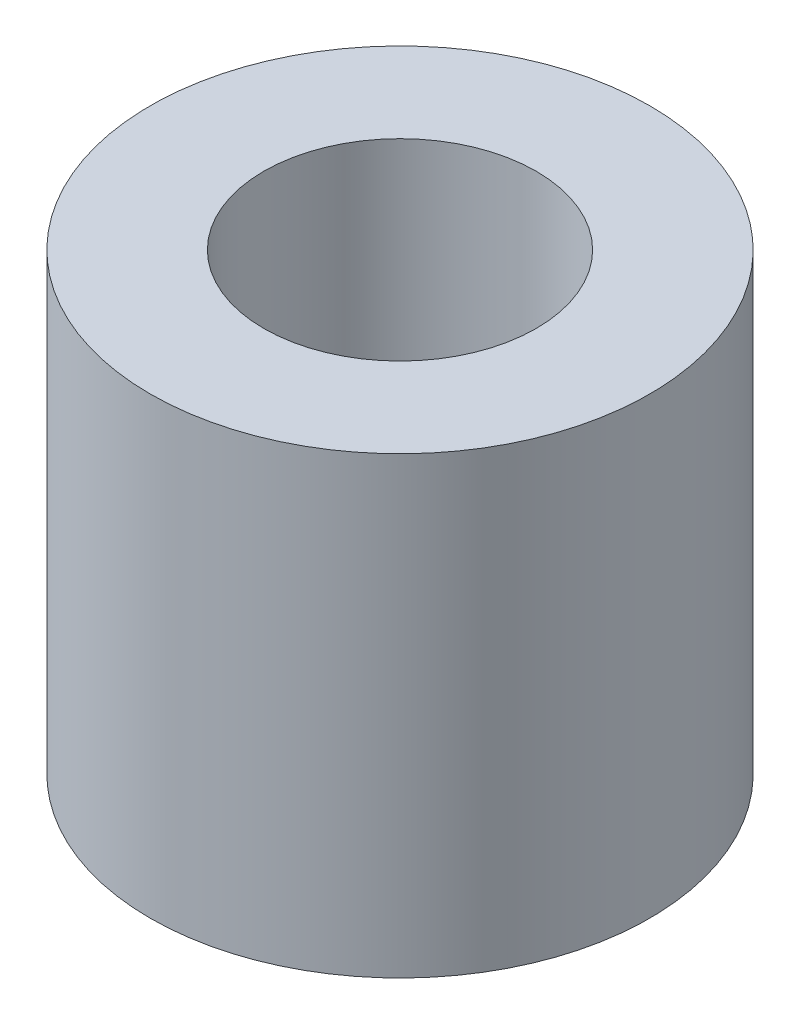
ISO-10303-21;
HEADER;
FILE_DESCRIPTION(('STEP AP214'),'2;1');
FILE_NAME('part.step','',(''),(''),'','','');
FILE_SCHEMA(('AUTOMOTIVE_DESIGN { 1 0 10303 214 1 1 1 1 }'));
ENDSEC;
DATA;
#1=APPLICATION_CONTEXT('core data for automotive mechanical design processes');
#2=APPLICATION_PROTOCOL_DEFINITION('international standard','automotive_design',2000,#1);
#3=PRODUCT_CONTEXT('',#1,'mechanical');
#4=PRODUCT('Part','Part','',(#3));
#5=PRODUCT_RELATED_PRODUCT_CATEGORY('part','',(#4));
#6=PRODUCT_DEFINITION_FORMATION('','',#4);
#7=PRODUCT_DEFINITION_CONTEXT('part definition',#1,'design');
#8=PRODUCT_DEFINITION('design','',#6,#7);
#9=PRODUCT_DEFINITION_SHAPE('','',#8);
#10=(LENGTH_UNIT() NAMED_UNIT(*) SI_UNIT(.MILLI.,.METRE.));
#11=(NAMED_UNIT(*) PLANE_ANGLE_UNIT() SI_UNIT($,.RADIAN.));
#12=(NAMED_UNIT(*) SI_UNIT($,.STERADIAN.) SOLID_ANGLE_UNIT());
#13=UNCERTAINTY_MEASURE_WITH_UNIT(LENGTH_MEASURE(1.E-05),#10,'distance_accuracy_value','');
#14=(GEOMETRIC_REPRESENTATION_CONTEXT(3) GLOBAL_UNCERTAINTY_ASSIGNED_CONTEXT((#13)) GLOBAL_UNIT_ASSIGNED_CONTEXT((#10,
#11,#12)) REPRESENTATION_CONTEXT('',''));
#15=CARTESIAN_POINT('',(0.,0.,0.));
#16=DIRECTION('',(0.,0.,1.));
#17=DIRECTION('',(1.,0.,0.));
#18=AXIS2_PLACEMENT_3D('',#15,#16,#17);
#19=CARTESIAN_POINT('',(0.,5.,0.));
#20=DIRECTION('',(0.,1.,0.));
#21=DIRECTION('',(0.,0.,1.));
#22=AXIS2_PLACEMENT_3D('',#19,#20,#21);
#23=PLANE('',#22);
#24=CARTESIAN_POINT('',(0.,5.,0.));
#25=DIRECTION('',(0.,1.,0.));
#26=DIRECTION('',(0.,0.,1.));
#27=AXIS2_PLACEMENT_3D('',#24,#25,#26);
#28=CIRCLE('',#27,2.75);
#29=CARTESIAN_POINT('',(0.,5.,2.75));
#30=VERTEX_POINT('',#29);
#31=EDGE_CURVE('E10',#30,#30,#28,.T.);
#32=ORIENTED_EDGE('',*,*,#31,.T.);
#33=EDGE_LOOP('',(#32));
#34=FACE_BOUND('',#33,.T.);
#35=CARTESIAN_POINT('',(0.,5.,0.));
#36=DIRECTION('',(0.,1.,0.));
#37=DIRECTION('',(0.,0.,1.));
#38=AXIS2_PLACEMENT_3D('',#35,#36,#37);
#39=CIRCLE('',#38,1.5);
#40=CARTESIAN_POINT('',(0.,5.,1.5));
#41=VERTEX_POINT('',#40);
#42=EDGE_CURVE('E43',#41,#41,#39,.T.);
#43=ORIENTED_EDGE('',*,*,#42,.F.);
#44=EDGE_LOOP('',(#43));
#45=FACE_BOUND('',#44,.T.);
#46=ADVANCED_FACE('F32',(#34,#45),#23,.T.);
#47=CARTESIAN_POINT('',(0.,0.,0.));
#48=DIRECTION('',(0.,1.,0.));
#49=DIRECTION('',(0.,0.,1.));
#50=AXIS2_PLACEMENT_3D('',#47,#48,#49);
#51=PLANE('',#50);
#52=CARTESIAN_POINT('',(0.,0.,0.));
#53=DIRECTION('',(0.,1.,0.));
#54=DIRECTION('',(0.,0.,1.));
#55=AXIS2_PLACEMENT_3D('',#52,#53,#54);
#56=CIRCLE('',#55,2.75);
#57=CARTESIAN_POINT('',(0.,0.,2.75));
#58=VERTEX_POINT('',#57);
#59=EDGE_CURVE('E36',#58,#58,#56,.T.);
#60=ORIENTED_EDGE('',*,*,#59,.F.);
#61=EDGE_LOOP('',(#60));
#62=FACE_BOUND('',#61,.T.);
#63=CARTESIAN_POINT('',(0.,0.,0.));
#64=DIRECTION('',(0.,1.,0.));
#65=DIRECTION('',(0.,0.,1.));
#66=AXIS2_PLACEMENT_3D('',#63,#64,#65);
#67=CIRCLE('',#66,1.5);
#68=CARTESIAN_POINT('',(0.,0.,1.5));
#69=VERTEX_POINT('',#68);
#70=EDGE_CURVE('E45',#69,#69,#67,.T.);
#71=ORIENTED_EDGE('',*,*,#70,.T.);
#72=EDGE_LOOP('',(#71));
#73=FACE_BOUND('',#72,.T.);
#74=ADVANCED_FACE('F55',(#62,#73),#51,.F.);
#75=CARTESIAN_POINT('',(0.,5.,0.));
#76=DIRECTION('',(0.,-1.,0.));
#77=DIRECTION('',(0.,0.,-1.));
#78=AXIS2_PLACEMENT_3D('',#75,#76,#77);
#79=CYLINDRICAL_SURFACE('',#78,2.75);
#80=ORIENTED_EDGE('',*,*,#31,.F.);
#81=EDGE_LOOP('',(#80));
#82=FACE_BOUND('',#81,.T.);
#83=ORIENTED_EDGE('',*,*,#59,.T.);
#84=EDGE_LOOP('',(#83));
#85=FACE_BOUND('',#84,.T.);
#86=ADVANCED_FACE('F34',(#82,#85),#79,.T.);
#87=CARTESIAN_POINT('',(0.,5.,0.));
#88=DIRECTION('',(0.,-1.,0.));
#89=DIRECTION('',(0.,0.,-1.));
#90=AXIS2_PLACEMENT_3D('',#87,#88,#89);
#91=CYLINDRICAL_SURFACE('',#90,1.5);
#92=ORIENTED_EDGE('',*,*,#42,.T.);
#93=EDGE_LOOP('',(#92));
#94=FACE_BOUND('',#93,.T.);
#95=ORIENTED_EDGE('',*,*,#70,.F.);
#96=EDGE_LOOP('',(#95));
#97=FACE_BOUND('',#96,.T.);
#98=ADVANCED_FACE('F51',(#94,#97),#91,.F.);
#99=CLOSED_SHELL('',(#46,#74,#86,#98));
#100=MANIFOLD_SOLID_BREP('B2',#99);
#101=ADVANCED_BREP_SHAPE_REPRESENTATION('',(#18,#100),#14);
#102=SHAPE_DEFINITION_REPRESENTATION(#9,#101);
ENDSEC;
END-ISO-10303-21;
